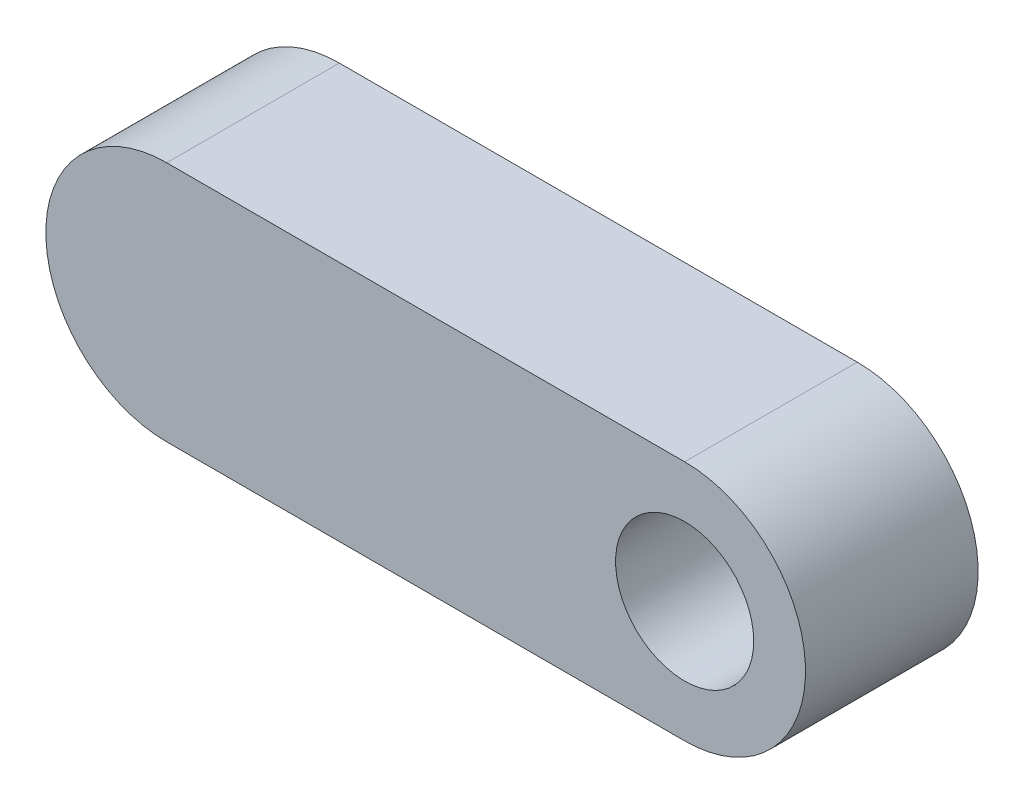
ISO-10303-21;
HEADER;
FILE_DESCRIPTION(('STEP AP214'),'2;1');
FILE_NAME('part.step','',(''),(''),'','','');
FILE_SCHEMA(('AUTOMOTIVE_DESIGN { 1 0 10303 214 1 1 1 1 }'));
ENDSEC;
DATA;
#1=APPLICATION_CONTEXT('core data for automotive mechanical design processes');
#2=APPLICATION_PROTOCOL_DEFINITION('international standard','automotive_design',2000,#1);
#3=PRODUCT_CONTEXT('',#1,'mechanical');
#4=PRODUCT('Part','Part','',(#3));
#5=PRODUCT_RELATED_PRODUCT_CATEGORY('part','',(#4));
#6=PRODUCT_DEFINITION_FORMATION('','',#4);
#7=PRODUCT_DEFINITION_CONTEXT('part definition',#1,'design');
#8=PRODUCT_DEFINITION('design','',#6,#7);
#9=PRODUCT_DEFINITION_SHAPE('','',#8);
#10=(LENGTH_UNIT() NAMED_UNIT(*) SI_UNIT(.MILLI.,.METRE.));
#11=(NAMED_UNIT(*) PLANE_ANGLE_UNIT() SI_UNIT($,.RADIAN.));
#12=(NAMED_UNIT(*) SI_UNIT($,.STERADIAN.) SOLID_ANGLE_UNIT());
#13=UNCERTAINTY_MEASURE_WITH_UNIT(LENGTH_MEASURE(1.E-05),#10,'distance_accuracy_value','');
#14=(GEOMETRIC_REPRESENTATION_CONTEXT(3) GLOBAL_UNCERTAINTY_ASSIGNED_CONTEXT((#13)) GLOBAL_UNIT_ASSIGNED_CONTEXT((#10,
#11,#12)) REPRESENTATION_CONTEXT('',''));
#15=CARTESIAN_POINT('',(0.,0.,0.));
#16=DIRECTION('',(0.,0.,1.));
#17=DIRECTION('',(1.,0.,0.));
#18=AXIS2_PLACEMENT_3D('',#15,#16,#17);
#19=CARTESIAN_POINT('',(0.,0.,100.));
#20=DIRECTION('',(0.,0.,-1.));
#21=DIRECTION('',(-1.,0.,0.));
#22=AXIS2_PLACEMENT_3D('',#19,#20,#21);
#23=CYLINDRICAL_SURFACE('',#22,70.);
#24=CARTESIAN_POINT('',(0.,0.,0.));
#25=DIRECTION('',(0.,0.,1.));
#26=DIRECTION('',(1.,0.,0.));
#27=AXIS2_PLACEMENT_3D('',#24,#25,#26);
#28=CIRCLE('',#27,70.);
#29=CARTESIAN_POINT('',(0.,70.,0.));
#30=VERTEX_POINT('',#29);
#31=CARTESIAN_POINT('',(0.,-70.,0.));
#32=VERTEX_POINT('',#31);
#33=EDGE_CURVE('E95',#30,#32,#28,.T.);
#34=ORIENTED_EDGE('',*,*,#33,.T.);
#35=DIRECTION('',(0.,0.,-1.));
#36=VECTOR('',#35,1.);
#37=CARTESIAN_POINT('',(0.,-70.,100.));
#38=LINE('',#37,#36);
#39=CARTESIAN_POINT('',(0.,-70.,100.));
#40=VERTEX_POINT('',#39);
#41=EDGE_CURVE('E11',#40,#32,#38,.T.);
#42=ORIENTED_EDGE('',*,*,#41,.F.);
#43=CARTESIAN_POINT('',(0.,0.,100.));
#44=DIRECTION('',(0.,0.,1.));
#45=DIRECTION('',(1.,0.,0.));
#46=AXIS2_PLACEMENT_3D('',#43,#44,#45);
#47=CIRCLE('',#46,70.);
#48=CARTESIAN_POINT('',(0.,70.,100.));
#49=VERTEX_POINT('',#48);
#50=EDGE_CURVE('E83',#49,#40,#47,.T.);
#51=ORIENTED_EDGE('',*,*,#50,.F.);
#52=DIRECTION('',(0.,0.,-1.));
#53=VECTOR('',#52,1.);
#54=CARTESIAN_POINT('',(0.,70.,100.));
#55=LINE('',#54,#53);
#56=EDGE_CURVE('E91',#49,#30,#55,.T.);
#57=ORIENTED_EDGE('',*,*,#56,.T.);
#58=EDGE_LOOP('',(#34,#42,#51,#57));
#59=FACE_BOUND('',#58,.T.);
#60=ADVANCED_FACE('F32',(#59),#23,.T.);
#61=CARTESIAN_POINT('',(0.,-70.,100.));
#62=DIRECTION('',(0.,1.,0.));
#63=DIRECTION('',(0.,0.,1.));
#64=AXIS2_PLACEMENT_3D('',#61,#62,#63);
#65=PLANE('',#64);
#66=DIRECTION('',(1.,0.,0.));
#67=VECTOR('',#66,1.);
#68=CARTESIAN_POINT('',(0.,-70.,0.));
#69=LINE('',#68,#67);
#70=CARTESIAN_POINT('',(300.,-70.,0.));
#71=VERTEX_POINT('',#70);
#72=EDGE_CURVE('E87',#32,#71,#69,.T.);
#73=ORIENTED_EDGE('',*,*,#72,.T.);
#74=DIRECTION('',(0.,0.,-1.));
#75=VECTOR('',#74,1.);
#76=CARTESIAN_POINT('',(300.,-70.,100.));
#77=LINE('',#76,#75);
#78=CARTESIAN_POINT('',(300.,-70.,100.));
#79=VERTEX_POINT('',#78);
#80=EDGE_CURVE('E40',#79,#71,#77,.T.);
#81=ORIENTED_EDGE('',*,*,#80,.F.);
#82=DIRECTION('',(1.,0.,0.));
#83=VECTOR('',#82,1.);
#84=CARTESIAN_POINT('',(0.,-70.,100.));
#85=LINE('',#84,#83);
#86=EDGE_CURVE('E78',#40,#79,#85,.T.);
#87=ORIENTED_EDGE('',*,*,#86,.F.);
#88=ORIENTED_EDGE('',*,*,#41,.T.);
#89=EDGE_LOOP('',(#73,#81,#87,#88));
#90=FACE_BOUND('',#89,.T.);
#91=ADVANCED_FACE('F86',(#90),#65,.F.);
#92=CARTESIAN_POINT('',(300.,0.,100.));
#93=DIRECTION('',(0.,0.,-1.));
#94=DIRECTION('',(-1.,0.,0.));
#95=AXIS2_PLACEMENT_3D('',#92,#93,#94);
#96=CYLINDRICAL_SURFACE('',#95,70.);
#97=CARTESIAN_POINT('',(300.,0.,0.));
#98=DIRECTION('',(0.,0.,1.));
#99=DIRECTION('',(1.,0.,0.));
#100=AXIS2_PLACEMENT_3D('',#97,#98,#99);
#101=CIRCLE('',#100,70.);
#102=CARTESIAN_POINT('',(300.,70.,0.));
#103=VERTEX_POINT('',#102);
#104=EDGE_CURVE('E65',#71,#103,#101,.T.);
#105=ORIENTED_EDGE('',*,*,#104,.T.);
#106=DIRECTION('',(0.,0.,-1.));
#107=VECTOR('',#106,1.);
#108=CARTESIAN_POINT('',(300.,70.,100.));
#109=LINE('',#108,#107);
#110=CARTESIAN_POINT('',(300.,70.,100.));
#111=VERTEX_POINT('',#110);
#112=EDGE_CURVE('E88',#111,#103,#109,.T.);
#113=ORIENTED_EDGE('',*,*,#112,.F.);
#114=CARTESIAN_POINT('',(300.,0.,100.));
#115=DIRECTION('',(0.,0.,1.));
#116=DIRECTION('',(1.,0.,0.));
#117=AXIS2_PLACEMENT_3D('',#114,#115,#116);
#118=CIRCLE('',#117,70.);
#119=EDGE_CURVE('E81',#79,#111,#118,.T.);
#120=ORIENTED_EDGE('',*,*,#119,.F.);
#121=ORIENTED_EDGE('',*,*,#80,.T.);
#122=EDGE_LOOP('',(#105,#113,#120,#121));
#123=FACE_BOUND('',#122,.T.);
#124=ADVANCED_FACE('F89',(#123),#96,.T.);
#125=CARTESIAN_POINT('',(0.,70.,100.));
#126=DIRECTION('',(0.,-1.,0.));
#127=DIRECTION('',(0.,0.,-1.));
#128=AXIS2_PLACEMENT_3D('',#125,#126,#127);
#129=PLANE('',#128);
#130=DIRECTION('',(-1.,0.,0.));
#131=VECTOR('',#130,1.);
#132=CARTESIAN_POINT('',(0.,70.,0.));
#133=LINE('',#132,#131);
#134=EDGE_CURVE('E71',#103,#30,#133,.T.);
#135=ORIENTED_EDGE('',*,*,#134,.T.);
#136=ORIENTED_EDGE('',*,*,#56,.F.);
#137=DIRECTION('',(-1.,0.,0.));
#138=VECTOR('',#137,1.);
#139=CARTESIAN_POINT('',(0.,70.,100.));
#140=LINE('',#139,#138);
#141=EDGE_CURVE('E48',#111,#49,#140,.T.);
#142=ORIENTED_EDGE('',*,*,#141,.F.);
#143=ORIENTED_EDGE('',*,*,#112,.T.);
#144=EDGE_LOOP('',(#135,#136,#142,#143));
#145=FACE_BOUND('',#144,.T.);
#146=ADVANCED_FACE('F103',(#145),#129,.F.);
#147=CARTESIAN_POINT('',(0.,0.,100.));
#148=DIRECTION('',(0.,0.,1.));
#149=DIRECTION('',(1.,0.,0.));
#150=AXIS2_PLACEMENT_3D('',#147,#148,#149);
#151=PLANE('',#150);
#152=CARTESIAN_POINT('',(300.,0.,100.));
#153=DIRECTION('',(0.,0.,1.));
#154=DIRECTION('',(1.,0.,0.));
#155=AXIS2_PLACEMENT_3D('',#152,#153,#154);
#156=CIRCLE('',#155,40.);
#157=CARTESIAN_POINT('',(340.,0.,100.));
#158=VERTEX_POINT('',#157);
#159=EDGE_CURVE('E109',#158,#158,#156,.T.);
#160=ORIENTED_EDGE('',*,*,#159,.F.);
#161=EDGE_LOOP('',(#160));
#162=FACE_BOUND('',#161,.T.);
#163=ORIENTED_EDGE('',*,*,#50,.T.);
#164=ORIENTED_EDGE('',*,*,#86,.T.);
#165=ORIENTED_EDGE('',*,*,#119,.T.);
#166=ORIENTED_EDGE('',*,*,#141,.T.);
#167=EDGE_LOOP('',(#163,#164,#165,#166));
#168=FACE_BOUND('',#167,.T.);
#169=ADVANCED_FACE('F79',(#162,#168),#151,.T.);
#170=CARTESIAN_POINT('',(0.,0.,0.));
#171=DIRECTION('',(0.,0.,1.));
#172=DIRECTION('',(1.,0.,0.));
#173=AXIS2_PLACEMENT_3D('',#170,#171,#172);
#174=PLANE('',#173);
#175=CARTESIAN_POINT('',(300.,0.,0.));
#176=DIRECTION('',(0.,0.,1.));
#177=DIRECTION('',(1.,0.,0.));
#178=AXIS2_PLACEMENT_3D('',#175,#176,#177);
#179=CIRCLE('',#178,40.);
#180=CARTESIAN_POINT('',(340.,0.,0.));
#181=VERTEX_POINT('',#180);
#182=EDGE_CURVE('E98',#181,#181,#179,.T.);
#183=ORIENTED_EDGE('',*,*,#182,.T.);
#184=EDGE_LOOP('',(#183));
#185=FACE_BOUND('',#184,.T.);
#186=ORIENTED_EDGE('',*,*,#33,.F.);
#187=ORIENTED_EDGE('',*,*,#134,.F.);
#188=ORIENTED_EDGE('',*,*,#104,.F.);
#189=ORIENTED_EDGE('',*,*,#72,.F.);
#190=EDGE_LOOP('',(#186,#187,#188,#189));
#191=FACE_BOUND('',#190,.T.);
#192=ADVANCED_FACE('F106',(#185,#191),#174,.F.);
#193=CARTESIAN_POINT('',(300.,0.,0.));
#194=DIRECTION('',(0.,0.,1.));
#195=DIRECTION('',(1.,0.,0.));
#196=AXIS2_PLACEMENT_3D('',#193,#194,#195);
#197=CYLINDRICAL_SURFACE('',#196,40.);
#198=ORIENTED_EDGE('',*,*,#182,.F.);
#199=EDGE_LOOP('',(#198));
#200=FACE_BOUND('',#199,.T.);
#201=ORIENTED_EDGE('',*,*,#159,.T.);
#202=EDGE_LOOP('',(#201));
#203=FACE_BOUND('',#202,.T.);
#204=ADVANCED_FACE('F116',(#200,#203),#197,.F.);
#205=CLOSED_SHELL('',(#60,#91,#124,#146,#169,#192,#204));
#206=MANIFOLD_SOLID_BREP('B2',#205);
#207=ADVANCED_BREP_SHAPE_REPRESENTATION('',(#18,#206),#14);
#208=SHAPE_DEFINITION_REPRESENTATION(#9,#207);
ENDSEC;
END-ISO-10303-21;
